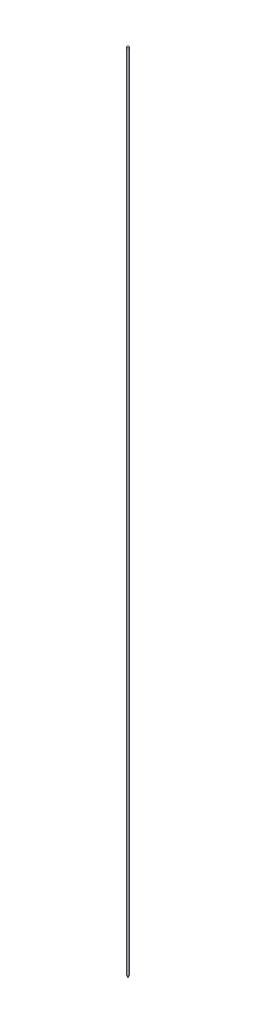
ISO-10303-21;
HEADER;
FILE_DESCRIPTION(('STEP AP214'),'2;1');
FILE_NAME('part.step','',(''),(''),'','','');
FILE_SCHEMA(('AUTOMOTIVE_DESIGN { 1 0 10303 214 1 1 1 1 }'));
ENDSEC;
DATA;
#1=APPLICATION_CONTEXT('core data for automotive mechanical design processes');
#2=APPLICATION_PROTOCOL_DEFINITION('international standard','automotive_design',2000,#1);
#3=PRODUCT_CONTEXT('',#1,'mechanical');
#4=PRODUCT('Part','Part','',(#3));
#5=PRODUCT_RELATED_PRODUCT_CATEGORY('part','',(#4));
#6=PRODUCT_DEFINITION_FORMATION('','',#4);
#7=PRODUCT_DEFINITION_CONTEXT('part definition',#1,'design');
#8=PRODUCT_DEFINITION('design','',#6,#7);
#9=PRODUCT_DEFINITION_SHAPE('','',#8);
#10=(LENGTH_UNIT() NAMED_UNIT(*) SI_UNIT(.MILLI.,.METRE.));
#11=(NAMED_UNIT(*) PLANE_ANGLE_UNIT() SI_UNIT($,.RADIAN.));
#12=(NAMED_UNIT(*) SI_UNIT($,.STERADIAN.) SOLID_ANGLE_UNIT());
#13=UNCERTAINTY_MEASURE_WITH_UNIT(LENGTH_MEASURE(1.E-05),#10,'distance_accuracy_value','');
#14=(GEOMETRIC_REPRESENTATION_CONTEXT(3) GLOBAL_UNCERTAINTY_ASSIGNED_CONTEXT((#13)) GLOBAL_UNIT_ASSIGNED_CONTEXT((#10,
#11,#12)) REPRESENTATION_CONTEXT('',''));
#15=CARTESIAN_POINT('',(0.,0.,0.));
#16=DIRECTION('',(0.,0.,1.));
#17=DIRECTION('',(1.,0.,0.));
#18=AXIS2_PLACEMENT_3D('',#15,#16,#17);
#19=CARTESIAN_POINT('',(1.22739034965834E-13,138.167565896088,0.));
#20=DIRECTION('',(0.,-1.,0.));
#21=DIRECTION('',(0.,0.,-1.));
#22=AXIS2_PLACEMENT_3D('',#19,#20,#21);
#23=PLANE('',#22);
#24=CARTESIAN_POINT('',(0.,138.167565896088,0.));
#25=DIRECTION('',(0.,1.,0.));
#26=DIRECTION('',(0.,0.,1.));
#27=AXIS2_PLACEMENT_3D('',#24,#25,#26);
#28=CIRCLE('',#27,1.58750000000011);
#29=CARTESIAN_POINT('',(0.,138.167565896088,1.58750000000011));
#30=VERTEX_POINT('',#29);
#31=EDGE_CURVE('E62',#30,#30,#28,.T.);
#32=ORIENTED_EDGE('',*,*,#31,.T.);
#33=EDGE_LOOP('',(#32));
#34=FACE_BOUND('',#33,.T.);
#35=ADVANCED_FACE('F34',(#34),#23,.F.);
#36=CARTESIAN_POINT('',(0.,11.2837513484358,0.));
#37=DIRECTION('',(0.,1.,0.));
#38=DIRECTION('',(0.,0.,1.));
#39=AXIS2_PLACEMENT_3D('',#36,#37,#38);
#40=CYLINDRICAL_SURFACE('',#39,1.58750000000005);
#41=CARTESIAN_POINT('',(0.,-987.04717267796,0.));
#42=DIRECTION('',(0.,-1.,0.));
#43=DIRECTION('',(0.,0.,-1.));
#44=AXIS2_PLACEMENT_3D('',#41,#42,#43);
#45=CIRCLE('',#44,1.58750000000005);
#46=CARTESIAN_POINT('',(0.,-987.04717267796,-1.58750000000005));
#47=VERTEX_POINT('',#46);
#48=EDGE_CURVE('E41',#47,#47,#45,.F.);
#49=ORIENTED_EDGE('',*,*,#48,.T.);
#50=EDGE_LOOP('',(#49));
#51=FACE_BOUND('',#50,.T.);
#52=ORIENTED_EDGE('',*,*,#31,.F.);
#53=EDGE_LOOP('',(#52));
#54=FACE_BOUND('',#53,.T.);
#55=ADVANCED_FACE('F46',(#51,#54),#40,.T.);
#56=CARTESIAN_POINT('',(0.,-990.956527655193,0.));
#57=DIRECTION('',(0.,1.,0.));
#58=DIRECTION('',(0.,0.,1.));
#59=AXIS2_PLACEMENT_3D('',#56,#57,#58);
#60=CONICAL_SURFACE('',#59,1.6549627903418E-13,0.404898933170157);
#61=CARTESIAN_POINT('',(0.,-987.441098545553,0.));
#62=DIRECTION('',(0.,-1.,0.));
#63=DIRECTION('',(0.,0.,-1.));
#64=AXIS2_PLACEMENT_3D('',#61,#62,#63);
#65=CIRCLE('',#64,1.50664221469866);
#66=CARTESIAN_POINT('',(0.,-987.441098545553,-1.50664221469866));
#67=VERTEX_POINT('',#66);
#68=EDGE_CURVE('E12',#67,#67,#65,.T.);
#69=ORIENTED_EDGE('',*,*,#68,.T.);
#70=EDGE_LOOP('',(#69));
#71=FACE_BOUND('',#70,.T.);
#72=CARTESIAN_POINT('',(1.22731685925359E-13,-990.956527655193,0.));
#73=VERTEX_POINT('',#72);
#74=VERTEX_LOOP('',#73);
#75=FACE_BOUND('',#74,.T.);
#76=ADVANCED_FACE('F44',(#71,#75),#60,.T.);
#77=CARTESIAN_POINT('',(0.,-987.04717267796,0.));
#78=DIRECTION('',(0.,-1.,0.));
#79=DIRECTION('',(0.,0.,-1.));
#80=AXIS2_PLACEMENT_3D('',#77,#78,#79);
#81=DEGENERATE_TOROIDAL_SURFACE('',#80,0.587500000000053,1.,.T.);
#82=ORIENTED_EDGE('',*,*,#68,.F.);
#83=EDGE_LOOP('',(#82));
#84=FACE_BOUND('',#83,.T.);
#85=ORIENTED_EDGE('',*,*,#48,.F.);
#86=EDGE_LOOP('',(#85));
#87=FACE_BOUND('',#86,.T.);
#88=ADVANCED_FACE('F36',(#84,#87),#81,.T.);
#89=CLOSED_SHELL('',(#35,#55,#76,#88));
#90=MANIFOLD_SOLID_BREP('B2',#89);
#91=ADVANCED_BREP_SHAPE_REPRESENTATION('',(#18,#90),#14);
#92=SHAPE_DEFINITION_REPRESENTATION(#9,#91);
ENDSEC;
END-ISO-10303-21;
